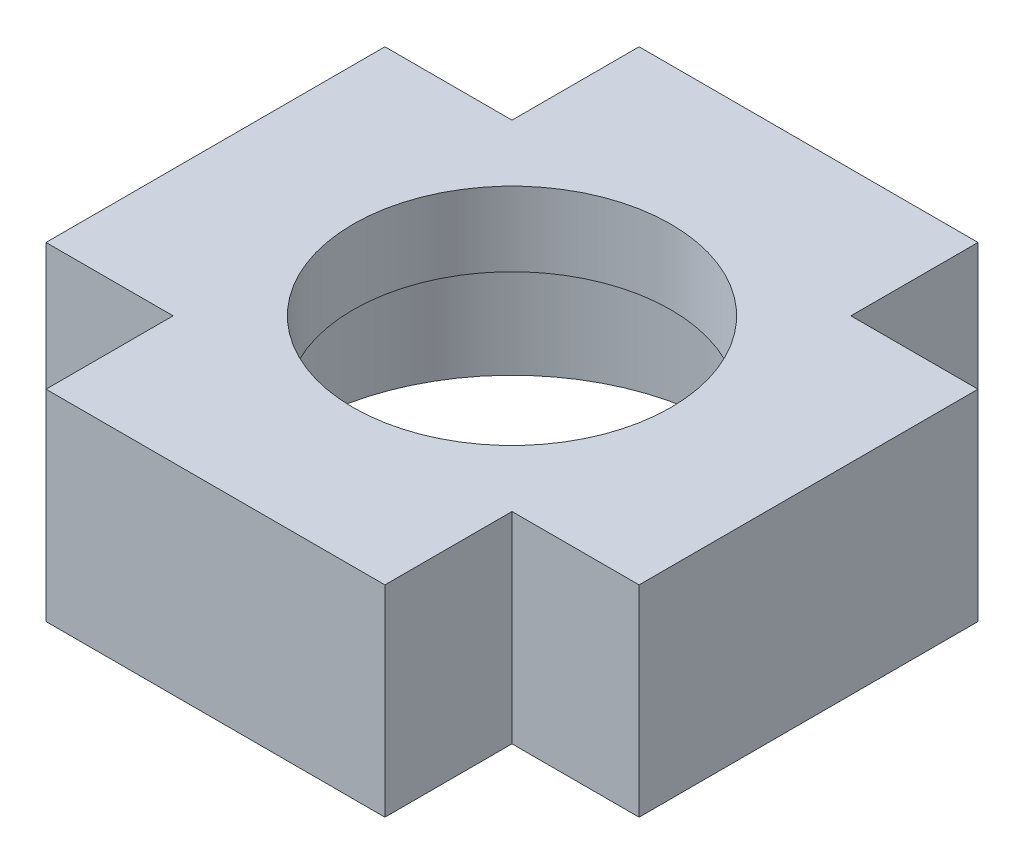
ISO-10303-21;
HEADER;
FILE_DESCRIPTION(('STEP AP214'),'2;1');
FILE_NAME('part.step','',(''),(''),'','','');
FILE_SCHEMA(('AUTOMOTIVE_DESIGN { 1 0 10303 214 1 1 1 1 }'));
ENDSEC;
DATA;
#1=APPLICATION_CONTEXT('core data for automotive mechanical design processes');
#2=APPLICATION_PROTOCOL_DEFINITION('international standard','automotive_design',2000,#1);
#3=PRODUCT_CONTEXT('',#1,'mechanical');
#4=PRODUCT('Part','Part','',(#3));
#5=PRODUCT_RELATED_PRODUCT_CATEGORY('part','',(#4));
#6=PRODUCT_DEFINITION_FORMATION('','',#4);
#7=PRODUCT_DEFINITION_CONTEXT('part definition',#1,'design');
#8=PRODUCT_DEFINITION('design','',#6,#7);
#9=PRODUCT_DEFINITION_SHAPE('','',#8);
#10=(LENGTH_UNIT() NAMED_UNIT(*) SI_UNIT(.MILLI.,.METRE.));
#11=(NAMED_UNIT(*) PLANE_ANGLE_UNIT() SI_UNIT($,.RADIAN.));
#12=(NAMED_UNIT(*) SI_UNIT($,.STERADIAN.) SOLID_ANGLE_UNIT());
#13=UNCERTAINTY_MEASURE_WITH_UNIT(LENGTH_MEASURE(1.E-05),#10,'distance_accuracy_value','');
#14=(GEOMETRIC_REPRESENTATION_CONTEXT(3) GLOBAL_UNCERTAINTY_ASSIGNED_CONTEXT((#13)) GLOBAL_UNIT_ASSIGNED_CONTEXT((#10,
#11,#12)) REPRESENTATION_CONTEXT('',''));
#15=CARTESIAN_POINT('',(0.,0.,0.));
#16=DIRECTION('',(0.,0.,1.));
#17=DIRECTION('',(1.,0.,0.));
#18=AXIS2_PLACEMENT_3D('',#15,#16,#17);
#19=CARTESIAN_POINT('',(0.,9.5,0.));
#20=DIRECTION('',(0.,-1.,0.));
#21=DIRECTION('',(0.,0.,-1.));
#22=AXIS2_PLACEMENT_3D('',#19,#20,#21);
#23=CYLINDRICAL_SURFACE('',#22,7.5);
#24=CARTESIAN_POINT('',(0.,9.5,0.));
#25=DIRECTION('',(0.,1.,0.));
#26=DIRECTION('',(0.,0.,1.));
#27=AXIS2_PLACEMENT_3D('',#24,#25,#26);
#28=CIRCLE('',#27,7.5);
#29=CARTESIAN_POINT('',(0.,9.5,7.5));
#30=VERTEX_POINT('',#29);
#31=EDGE_CURVE('E162',#30,#30,#28,.T.);
#32=ORIENTED_EDGE('',*,*,#31,.T.);
#33=EDGE_LOOP('',(#32));
#34=FACE_BOUND('',#33,.T.);
#35=CARTESIAN_POINT('',(0.,6.,0.));
#36=DIRECTION('',(0.,-1.,0.));
#37=DIRECTION('',(0.,0.,-1.));
#38=AXIS2_PLACEMENT_3D('',#35,#36,#37);
#39=CIRCLE('',#38,7.5);
#40=CARTESIAN_POINT('',(0.,6.,-7.5));
#41=VERTEX_POINT('',#40);
#42=EDGE_CURVE('E39',#41,#41,#39,.T.);
#43=ORIENTED_EDGE('',*,*,#42,.T.);
#44=EDGE_LOOP('',(#43));
#45=FACE_BOUND('',#44,.T.);
#46=ADVANCED_FACE('F35',(#34,#45),#23,.F.);
#47=CARTESIAN_POINT('',(0.,9.5,0.));
#48=DIRECTION('',(0.,-1.,0.));
#49=DIRECTION('',(0.,0.,-1.));
#50=AXIS2_PLACEMENT_3D('',#47,#48,#49);
#51=PLANE('',#50);
#52=DIRECTION('',(0.,0.,1.));
#53=VECTOR('',#52,1.);
#54=CARTESIAN_POINT('',(-8.00000000000001,9.5,-8.));
#55=LINE('',#54,#53);
#56=CARTESIAN_POINT('',(-8.00000000000001,9.5,-14.));
#57=VERTEX_POINT('',#56);
#58=CARTESIAN_POINT('',(-8.00000000000001,9.5,-8.));
#59=VERTEX_POINT('',#58);
#60=EDGE_CURVE('E181',#57,#59,#55,.T.);
#61=ORIENTED_EDGE('',*,*,#60,.T.);
#62=DIRECTION('',(-1.,0.,0.));
#63=VECTOR('',#62,1.);
#64=CARTESIAN_POINT('',(-14.,9.5,-8.));
#65=LINE('',#64,#63);
#66=CARTESIAN_POINT('',(-14.,9.5,-8.));
#67=VERTEX_POINT('',#66);
#68=EDGE_CURVE('E108',#59,#67,#65,.T.);
#69=ORIENTED_EDGE('',*,*,#68,.T.);
#70=DIRECTION('',(0.,0.,1.));
#71=VECTOR('',#70,1.);
#72=CARTESIAN_POINT('',(-14.,9.5,8.));
#73=LINE('',#72,#71);
#74=CARTESIAN_POINT('',(-14.,9.5,8.));
#75=VERTEX_POINT('',#74);
#76=EDGE_CURVE('E209',#67,#75,#73,.T.);
#77=ORIENTED_EDGE('',*,*,#76,.T.);
#78=DIRECTION('',(1.,0.,0.));
#79=VECTOR('',#78,1.);
#80=CARTESIAN_POINT('',(-8.,9.5,8.00000000000001));
#81=LINE('',#80,#79);
#82=CARTESIAN_POINT('',(-8.,9.5,8.00000000000001));
#83=VERTEX_POINT('',#82);
#84=EDGE_CURVE('E227',#75,#83,#81,.T.);
#85=ORIENTED_EDGE('',*,*,#84,.T.);
#86=DIRECTION('',(0.,0.,1.));
#87=VECTOR('',#86,1.);
#88=CARTESIAN_POINT('',(-8.,9.5,14.));
#89=LINE('',#88,#87);
#90=CARTESIAN_POINT('',(-8.,9.5,14.));
#91=VERTEX_POINT('',#90);
#92=EDGE_CURVE('E224',#83,#91,#89,.T.);
#93=ORIENTED_EDGE('',*,*,#92,.T.);
#94=DIRECTION('',(1.,0.,0.));
#95=VECTOR('',#94,1.);
#96=CARTESIAN_POINT('',(8.00000000000001,9.5,14.));
#97=LINE('',#96,#95);
#98=CARTESIAN_POINT('',(8.00000000000001,9.5,14.));
#99=VERTEX_POINT('',#98);
#100=EDGE_CURVE('E226',#91,#99,#97,.T.);
#101=ORIENTED_EDGE('',*,*,#100,.T.);
#102=DIRECTION('',(0.,0.,-1.));
#103=VECTOR('',#102,1.);
#104=CARTESIAN_POINT('',(8.,9.5,8.));
#105=LINE('',#104,#103);
#106=CARTESIAN_POINT('',(8.,9.5,8.));
#107=VERTEX_POINT('',#106);
#108=EDGE_CURVE('E229',#99,#107,#105,.T.);
#109=ORIENTED_EDGE('',*,*,#108,.T.);
#110=DIRECTION('',(1.,0.,0.));
#111=VECTOR('',#110,1.);
#112=CARTESIAN_POINT('',(14.,9.5,8.));
#113=LINE('',#112,#111);
#114=CARTESIAN_POINT('',(14.,9.5,8.));
#115=VERTEX_POINT('',#114);
#116=EDGE_CURVE('E235',#107,#115,#113,.T.);
#117=ORIENTED_EDGE('',*,*,#116,.T.);
#118=DIRECTION('',(0.,0.,-1.));
#119=VECTOR('',#118,1.);
#120=CARTESIAN_POINT('',(14.,9.5,-8.));
#121=LINE('',#120,#119);
#122=CARTESIAN_POINT('',(14.,9.5,-8.));
#123=VERTEX_POINT('',#122);
#124=EDGE_CURVE('E140',#115,#123,#121,.T.);
#125=ORIENTED_EDGE('',*,*,#124,.T.);
#126=DIRECTION('',(-1.,0.,0.));
#127=VECTOR('',#126,1.);
#128=CARTESIAN_POINT('',(8.00000000000001,9.5,-8.));
#129=LINE('',#128,#127);
#130=CARTESIAN_POINT('',(8.00000000000001,9.5,-8.));
#131=VERTEX_POINT('',#130);
#132=EDGE_CURVE('E133',#123,#131,#129,.T.);
#133=ORIENTED_EDGE('',*,*,#132,.T.);
#134=DIRECTION('',(0.,0.,-1.));
#135=VECTOR('',#134,1.);
#136=CARTESIAN_POINT('',(8.,9.5,-14.));
#137=LINE('',#136,#135);
#138=CARTESIAN_POINT('',(8.,9.5,-14.));
#139=VERTEX_POINT('',#138);
#140=EDGE_CURVE('E138',#131,#139,#137,.T.);
#141=ORIENTED_EDGE('',*,*,#140,.T.);
#142=DIRECTION('',(-1.,0.,0.));
#143=VECTOR('',#142,1.);
#144=CARTESIAN_POINT('',(-8.00000000000001,9.5,-14.));
#145=LINE('',#144,#143);
#146=EDGE_CURVE('E53',#139,#57,#145,.T.);
#147=ORIENTED_EDGE('',*,*,#146,.T.);
#148=EDGE_LOOP('',(#61,#69,#77,#85,#93,#101,#109,#117,#125,#133,#141,#147));
#149=FACE_BOUND('',#148,.T.);
#150=ORIENTED_EDGE('',*,*,#31,.F.);
#151=EDGE_LOOP('',(#150));
#152=FACE_BOUND('',#151,.T.);
#153=ADVANCED_FACE('F135',(#149,#152),#51,.F.);
#154=CARTESIAN_POINT('',(0.,0.,0.));
#155=DIRECTION('',(0.,-1.,0.));
#156=DIRECTION('',(0.,0.,-1.));
#157=AXIS2_PLACEMENT_3D('',#154,#155,#156);
#158=PLANE('',#157);
#159=CARTESIAN_POINT('',(0.,0.,0.));
#160=DIRECTION('',(0.,-1.,0.));
#161=DIRECTION('',(0.,0.,-1.));
#162=AXIS2_PLACEMENT_3D('',#159,#160,#161);
#163=CIRCLE('',#162,10.);
#164=CARTESIAN_POINT('',(0.,0.,-10.));
#165=VERTEX_POINT('',#164);
#166=EDGE_CURVE('E280',#165,#165,#163,.T.);
#167=ORIENTED_EDGE('',*,*,#166,.F.);
#168=EDGE_LOOP('',(#167));
#169=FACE_BOUND('',#168,.T.);
#170=DIRECTION('',(0.,0.,1.));
#171=VECTOR('',#170,1.);
#172=CARTESIAN_POINT('',(-8.00000000000001,0.,-8.));
#173=LINE('',#172,#171);
#174=CARTESIAN_POINT('',(-8.00000000000001,0.,-14.));
#175=VERTEX_POINT('',#174);
#176=CARTESIAN_POINT('',(-8.00000000000001,0.,-8.));
#177=VERTEX_POINT('',#176);
#178=EDGE_CURVE('E158',#175,#177,#173,.T.);
#179=ORIENTED_EDGE('',*,*,#178,.F.);
#180=DIRECTION('',(-1.,0.,0.));
#181=VECTOR('',#180,1.);
#182=CARTESIAN_POINT('',(-8.00000000000001,0.,-14.));
#183=LINE('',#182,#181);
#184=CARTESIAN_POINT('',(8.,0.,-14.));
#185=VERTEX_POINT('',#184);
#186=EDGE_CURVE('E100',#185,#175,#183,.T.);
#187=ORIENTED_EDGE('',*,*,#186,.F.);
#188=DIRECTION('',(0.,0.,-1.));
#189=VECTOR('',#188,1.);
#190=CARTESIAN_POINT('',(8.,0.,-14.));
#191=LINE('',#190,#189);
#192=CARTESIAN_POINT('',(8.00000000000001,0.,-8.));
#193=VERTEX_POINT('',#192);
#194=EDGE_CURVE('E94',#193,#185,#191,.T.);
#195=ORIENTED_EDGE('',*,*,#194,.F.);
#196=DIRECTION('',(-1.,0.,0.));
#197=VECTOR('',#196,1.);
#198=CARTESIAN_POINT('',(8.00000000000001,0.,-8.));
#199=LINE('',#198,#197);
#200=CARTESIAN_POINT('',(14.,0.,-8.));
#201=VERTEX_POINT('',#200);
#202=EDGE_CURVE('E148',#201,#193,#199,.T.);
#203=ORIENTED_EDGE('',*,*,#202,.F.);
#204=DIRECTION('',(0.,0.,-1.));
#205=VECTOR('',#204,1.);
#206=CARTESIAN_POINT('',(14.,0.,-8.));
#207=LINE('',#206,#205);
#208=CARTESIAN_POINT('',(14.,0.,8.));
#209=VERTEX_POINT('',#208);
#210=EDGE_CURVE('E176',#209,#201,#207,.T.);
#211=ORIENTED_EDGE('',*,*,#210,.F.);
#212=DIRECTION('',(1.,0.,0.));
#213=VECTOR('',#212,1.);
#214=CARTESIAN_POINT('',(14.,0.,8.));
#215=LINE('',#214,#213);
#216=CARTESIAN_POINT('',(8.,0.,8.));
#217=VERTEX_POINT('',#216);
#218=EDGE_CURVE('E174',#217,#209,#215,.T.);
#219=ORIENTED_EDGE('',*,*,#218,.F.);
#220=DIRECTION('',(0.,0.,-1.));
#221=VECTOR('',#220,1.);
#222=CARTESIAN_POINT('',(8.,0.,8.));
#223=LINE('',#222,#221);
#224=CARTESIAN_POINT('',(8.00000000000001,0.,14.));
#225=VERTEX_POINT('',#224);
#226=EDGE_CURVE('E172',#225,#217,#223,.T.);
#227=ORIENTED_EDGE('',*,*,#226,.F.);
#228=DIRECTION('',(1.,0.,0.));
#229=VECTOR('',#228,1.);
#230=CARTESIAN_POINT('',(8.00000000000001,0.,14.));
#231=LINE('',#230,#229);
#232=CARTESIAN_POINT('',(-8.,0.,14.));
#233=VERTEX_POINT('',#232);
#234=EDGE_CURVE('E170',#233,#225,#231,.T.);
#235=ORIENTED_EDGE('',*,*,#234,.F.);
#236=DIRECTION('',(0.,0.,1.));
#237=VECTOR('',#236,1.);
#238=CARTESIAN_POINT('',(-8.,0.,14.));
#239=LINE('',#238,#237);
#240=CARTESIAN_POINT('',(-8.,0.,8.00000000000001));
#241=VERTEX_POINT('',#240);
#242=EDGE_CURVE('E168',#241,#233,#239,.T.);
#243=ORIENTED_EDGE('',*,*,#242,.F.);
#244=DIRECTION('',(1.,0.,0.));
#245=VECTOR('',#244,1.);
#246=CARTESIAN_POINT('',(-8.,0.,8.00000000000001));
#247=LINE('',#246,#245);
#248=CARTESIAN_POINT('',(-14.,0.,8.));
#249=VERTEX_POINT('',#248);
#250=EDGE_CURVE('E166',#249,#241,#247,.T.);
#251=ORIENTED_EDGE('',*,*,#250,.F.);
#252=DIRECTION('',(0.,0.,1.));
#253=VECTOR('',#252,1.);
#254=CARTESIAN_POINT('',(-14.,0.,8.));
#255=LINE('',#254,#253);
#256=CARTESIAN_POINT('',(-14.,0.,-8.));
#257=VERTEX_POINT('',#256);
#258=EDGE_CURVE('E164',#257,#249,#255,.T.);
#259=ORIENTED_EDGE('',*,*,#258,.F.);
#260=DIRECTION('',(-1.,0.,0.));
#261=VECTOR('',#260,1.);
#262=CARTESIAN_POINT('',(-14.,0.,-8.));
#263=LINE('',#262,#261);
#264=EDGE_CURVE('E161',#177,#257,#263,.T.);
#265=ORIENTED_EDGE('',*,*,#264,.F.);
#266=EDGE_LOOP('',(#179,#187,#195,#203,#211,#219,#227,#235,#243,#251,#259,#265));
#267=FACE_BOUND('',#266,.T.);
#268=ADVANCED_FACE('F213',(#169,#267),#158,.T.);
#269=CARTESIAN_POINT('',(-8.00000000000001,9.5,-8.));
#270=DIRECTION('',(1.,0.,0.));
#271=DIRECTION('',(0.,0.,-1.));
#272=AXIS2_PLACEMENT_3D('',#269,#270,#271);
#273=PLANE('',#272);
#274=ORIENTED_EDGE('',*,*,#178,.T.);
#275=DIRECTION('',(0.,-1.,0.));
#276=VECTOR('',#275,1.);
#277=CARTESIAN_POINT('',(-8.00000000000001,9.5,-8.));
#278=LINE('',#277,#276);
#279=EDGE_CURVE('E11',#59,#177,#278,.T.);
#280=ORIENTED_EDGE('',*,*,#279,.F.);
#281=ORIENTED_EDGE('',*,*,#60,.F.);
#282=DIRECTION('',(0.,-1.,0.));
#283=VECTOR('',#282,1.);
#284=CARTESIAN_POINT('',(-8.00000000000001,9.5,-14.));
#285=LINE('',#284,#283);
#286=EDGE_CURVE('E154',#57,#175,#285,.T.);
#287=ORIENTED_EDGE('',*,*,#286,.T.);
#288=EDGE_LOOP('',(#274,#280,#281,#287));
#289=FACE_BOUND('',#288,.T.);
#290=ADVANCED_FACE('F37',(#289),#273,.F.);
#291=CARTESIAN_POINT('',(-14.,9.5,-8.));
#292=DIRECTION('',(0.,0.,1.));
#293=DIRECTION('',(1.,0.,0.));
#294=AXIS2_PLACEMENT_3D('',#291,#292,#293);
#295=PLANE('',#294);
#296=ORIENTED_EDGE('',*,*,#264,.T.);
#297=DIRECTION('',(0.,-1.,0.));
#298=VECTOR('',#297,1.);
#299=CARTESIAN_POINT('',(-14.,9.5,-8.));
#300=LINE('',#299,#298);
#301=EDGE_CURVE('E45',#67,#257,#300,.T.);
#302=ORIENTED_EDGE('',*,*,#301,.F.);
#303=ORIENTED_EDGE('',*,*,#68,.F.);
#304=ORIENTED_EDGE('',*,*,#279,.T.);
#305=EDGE_LOOP('',(#296,#302,#303,#304));
#306=FACE_BOUND('',#305,.T.);
#307=ADVANCED_FACE('F277',(#306),#295,.F.);
#308=CARTESIAN_POINT('',(-14.,9.5,8.));
#309=DIRECTION('',(1.,0.,0.));
#310=DIRECTION('',(0.,0.,-1.));
#311=AXIS2_PLACEMENT_3D('',#308,#309,#310);
#312=PLANE('',#311);
#313=ORIENTED_EDGE('',*,*,#258,.T.);
#314=DIRECTION('',(0.,-1.,0.));
#315=VECTOR('',#314,1.);
#316=CARTESIAN_POINT('',(-14.,9.5,8.));
#317=LINE('',#316,#315);
#318=EDGE_CURVE('E200',#75,#249,#317,.T.);
#319=ORIENTED_EDGE('',*,*,#318,.F.);
#320=ORIENTED_EDGE('',*,*,#76,.F.);
#321=ORIENTED_EDGE('',*,*,#301,.T.);
#322=EDGE_LOOP('',(#313,#319,#320,#321));
#323=FACE_BOUND('',#322,.T.);
#324=ADVANCED_FACE('F207',(#323),#312,.F.);
#325=CARTESIAN_POINT('',(-8.,9.5,8.00000000000001));
#326=DIRECTION('',(0.,0.,-1.));
#327=DIRECTION('',(-1.,0.,0.));
#328=AXIS2_PLACEMENT_3D('',#325,#326,#327);
#329=PLANE('',#328);
#330=ORIENTED_EDGE('',*,*,#250,.T.);
#331=DIRECTION('',(0.,-1.,0.));
#332=VECTOR('',#331,1.);
#333=CARTESIAN_POINT('',(-8.,9.5,8.00000000000001));
#334=LINE('',#333,#332);
#335=EDGE_CURVE('E197',#83,#241,#334,.T.);
#336=ORIENTED_EDGE('',*,*,#335,.F.);
#337=ORIENTED_EDGE('',*,*,#84,.F.);
#338=ORIENTED_EDGE('',*,*,#318,.T.);
#339=EDGE_LOOP('',(#330,#336,#337,#338));
#340=FACE_BOUND('',#339,.T.);
#341=ADVANCED_FACE('F218',(#340),#329,.F.);
#342=CARTESIAN_POINT('',(-8.,9.5,14.));
#343=DIRECTION('',(1.,0.,0.));
#344=DIRECTION('',(0.,0.,-1.));
#345=AXIS2_PLACEMENT_3D('',#342,#343,#344);
#346=PLANE('',#345);
#347=ORIENTED_EDGE('',*,*,#242,.T.);
#348=DIRECTION('',(0.,-1.,0.));
#349=VECTOR('',#348,1.);
#350=CARTESIAN_POINT('',(-8.,9.5,14.));
#351=LINE('',#350,#349);
#352=EDGE_CURVE('E194',#91,#233,#351,.T.);
#353=ORIENTED_EDGE('',*,*,#352,.F.);
#354=ORIENTED_EDGE('',*,*,#92,.F.);
#355=ORIENTED_EDGE('',*,*,#335,.T.);
#356=EDGE_LOOP('',(#347,#353,#354,#355));
#357=FACE_BOUND('',#356,.T.);
#358=ADVANCED_FACE('F222',(#357),#346,.F.);
#359=CARTESIAN_POINT('',(8.00000000000001,9.5,14.));
#360=DIRECTION('',(0.,0.,-1.));
#361=DIRECTION('',(-1.,0.,0.));
#362=AXIS2_PLACEMENT_3D('',#359,#360,#361);
#363=PLANE('',#362);
#364=ORIENTED_EDGE('',*,*,#234,.T.);
#365=DIRECTION('',(0.,-1.,0.));
#366=VECTOR('',#365,1.);
#367=CARTESIAN_POINT('',(8.00000000000001,9.5,14.));
#368=LINE('',#367,#366);
#369=EDGE_CURVE('E191',#99,#225,#368,.T.);
#370=ORIENTED_EDGE('',*,*,#369,.F.);
#371=ORIENTED_EDGE('',*,*,#100,.F.);
#372=ORIENTED_EDGE('',*,*,#352,.T.);
#373=EDGE_LOOP('',(#364,#370,#371,#372));
#374=FACE_BOUND('',#373,.T.);
#375=ADVANCED_FACE('F356',(#374),#363,.F.);
#376=CARTESIAN_POINT('',(8.,9.5,8.));
#377=DIRECTION('',(-1.,0.,0.));
#378=DIRECTION('',(0.,0.,1.));
#379=AXIS2_PLACEMENT_3D('',#376,#377,#378);
#380=PLANE('',#379);
#381=ORIENTED_EDGE('',*,*,#226,.T.);
#382=DIRECTION('',(0.,-1.,0.));
#383=VECTOR('',#382,1.);
#384=CARTESIAN_POINT('',(8.,9.5,8.));
#385=LINE('',#384,#383);
#386=EDGE_CURVE('E188',#107,#217,#385,.T.);
#387=ORIENTED_EDGE('',*,*,#386,.F.);
#388=ORIENTED_EDGE('',*,*,#108,.F.);
#389=ORIENTED_EDGE('',*,*,#369,.T.);
#390=EDGE_LOOP('',(#381,#387,#388,#389));
#391=FACE_BOUND('',#390,.T.);
#392=ADVANCED_FACE('F347',(#391),#380,.F.);
#393=CARTESIAN_POINT('',(14.,9.5,8.));
#394=DIRECTION('',(0.,0.,-1.));
#395=DIRECTION('',(-1.,0.,0.));
#396=AXIS2_PLACEMENT_3D('',#393,#394,#395);
#397=PLANE('',#396);
#398=ORIENTED_EDGE('',*,*,#218,.T.);
#399=DIRECTION('',(0.,-1.,0.));
#400=VECTOR('',#399,1.);
#401=CARTESIAN_POINT('',(14.,9.5,8.));
#402=LINE('',#401,#400);
#403=EDGE_CURVE('E185',#115,#209,#402,.T.);
#404=ORIENTED_EDGE('',*,*,#403,.F.);
#405=ORIENTED_EDGE('',*,*,#116,.F.);
#406=ORIENTED_EDGE('',*,*,#386,.T.);
#407=EDGE_LOOP('',(#398,#404,#405,#406));
#408=FACE_BOUND('',#407,.T.);
#409=ADVANCED_FACE('F241',(#408),#397,.F.);
#410=CARTESIAN_POINT('',(14.,9.5,-8.));
#411=DIRECTION('',(-1.,0.,0.));
#412=DIRECTION('',(0.,0.,1.));
#413=AXIS2_PLACEMENT_3D('',#410,#411,#412);
#414=PLANE('',#413);
#415=ORIENTED_EDGE('',*,*,#210,.T.);
#416=DIRECTION('',(0.,-1.,0.));
#417=VECTOR('',#416,1.);
#418=CARTESIAN_POINT('',(14.,9.5,-8.));
#419=LINE('',#418,#417);
#420=EDGE_CURVE('E149',#123,#201,#419,.T.);
#421=ORIENTED_EDGE('',*,*,#420,.F.);
#422=ORIENTED_EDGE('',*,*,#124,.F.);
#423=ORIENTED_EDGE('',*,*,#403,.T.);
#424=EDGE_LOOP('',(#415,#421,#422,#423));
#425=FACE_BOUND('',#424,.T.);
#426=ADVANCED_FACE('F245',(#425),#414,.F.);
#427=CARTESIAN_POINT('',(8.00000000000001,9.5,-8.));
#428=DIRECTION('',(0.,0.,1.));
#429=DIRECTION('',(1.,0.,0.));
#430=AXIS2_PLACEMENT_3D('',#427,#428,#429);
#431=PLANE('',#430);
#432=ORIENTED_EDGE('',*,*,#202,.T.);
#433=DIRECTION('',(0.,-1.,0.));
#434=VECTOR('',#433,1.);
#435=CARTESIAN_POINT('',(8.00000000000001,9.5,-8.));
#436=LINE('',#435,#434);
#437=EDGE_CURVE('E145',#131,#193,#436,.T.);
#438=ORIENTED_EDGE('',*,*,#437,.F.);
#439=ORIENTED_EDGE('',*,*,#132,.F.);
#440=ORIENTED_EDGE('',*,*,#420,.T.);
#441=EDGE_LOOP('',(#432,#438,#439,#440));
#442=FACE_BOUND('',#441,.T.);
#443=ADVANCED_FACE('F146',(#442),#431,.F.);
#444=CARTESIAN_POINT('',(8.,9.5,-14.));
#445=DIRECTION('',(-1.,0.,0.));
#446=DIRECTION('',(0.,0.,1.));
#447=AXIS2_PLACEMENT_3D('',#444,#445,#446);
#448=PLANE('',#447);
#449=ORIENTED_EDGE('',*,*,#194,.T.);
#450=DIRECTION('',(0.,-1.,0.));
#451=VECTOR('',#450,1.);
#452=CARTESIAN_POINT('',(8.,9.5,-14.));
#453=LINE('',#452,#451);
#454=EDGE_CURVE('E150',#139,#185,#453,.T.);
#455=ORIENTED_EDGE('',*,*,#454,.F.);
#456=ORIENTED_EDGE('',*,*,#140,.F.);
#457=ORIENTED_EDGE('',*,*,#437,.T.);
#458=EDGE_LOOP('',(#449,#455,#456,#457));
#459=FACE_BOUND('',#458,.T.);
#460=ADVANCED_FACE('F152',(#459),#448,.F.);
#461=CARTESIAN_POINT('',(-8.00000000000001,9.5,-14.));
#462=DIRECTION('',(0.,0.,1.));
#463=DIRECTION('',(1.,0.,0.));
#464=AXIS2_PLACEMENT_3D('',#461,#462,#463);
#465=PLANE('',#464);
#466=ORIENTED_EDGE('',*,*,#186,.T.);
#467=ORIENTED_EDGE('',*,*,#286,.F.);
#468=ORIENTED_EDGE('',*,*,#146,.F.);
#469=ORIENTED_EDGE('',*,*,#454,.T.);
#470=EDGE_LOOP('',(#466,#467,#468,#469));
#471=FACE_BOUND('',#470,.T.);
#472=ADVANCED_FACE('F249',(#471),#465,.F.);
#473=CARTESIAN_POINT('',(0.,6.,0.));
#474=DIRECTION('',(0.,-1.,0.));
#475=DIRECTION('',(0.,0.,-1.));
#476=AXIS2_PLACEMENT_3D('',#473,#474,#475);
#477=CYLINDRICAL_SURFACE('',#476,10.);
#478=CARTESIAN_POINT('',(0.,6.,0.));
#479=DIRECTION('',(0.,-1.,0.));
#480=DIRECTION('',(0.,0.,-1.));
#481=AXIS2_PLACEMENT_3D('',#478,#479,#480);
#482=CIRCLE('',#481,10.);
#483=CARTESIAN_POINT('',(0.,6.,-10.));
#484=VERTEX_POINT('',#483);
#485=EDGE_CURVE('E282',#484,#484,#482,.T.);
#486=ORIENTED_EDGE('',*,*,#485,.F.);
#487=EDGE_LOOP('',(#486));
#488=FACE_BOUND('',#487,.T.);
#489=ORIENTED_EDGE('',*,*,#166,.T.);
#490=EDGE_LOOP('',(#489));
#491=FACE_BOUND('',#490,.T.);
#492=ADVANCED_FACE('F251',(#488,#491),#477,.F.);
#493=CARTESIAN_POINT('',(0.,6.,0.));
#494=DIRECTION('',(0.,-1.,0.));
#495=DIRECTION('',(0.,0.,-1.));
#496=AXIS2_PLACEMENT_3D('',#493,#494,#495);
#497=PLANE('',#496);
#498=ORIENTED_EDGE('',*,*,#42,.F.);
#499=EDGE_LOOP('',(#498));
#500=FACE_BOUND('',#499,.T.);
#501=ORIENTED_EDGE('',*,*,#485,.T.);
#502=EDGE_LOOP('',(#501));
#503=FACE_BOUND('',#502,.T.);
#504=ADVANCED_FACE('F257',(#500,#503),#497,.T.);
#505=CLOSED_SHELL('',(#46,#153,#268,#290,#307,#324,#341,#358,#375,#392,#409,#426,#443,#460,#472,
#492,#504));
#506=MANIFOLD_SOLID_BREP('B2',#505);
#507=ADVANCED_BREP_SHAPE_REPRESENTATION('',(#18,#506),#14);
#508=SHAPE_DEFINITION_REPRESENTATION(#9,#507);
ENDSEC;
END-ISO-10303-21;
